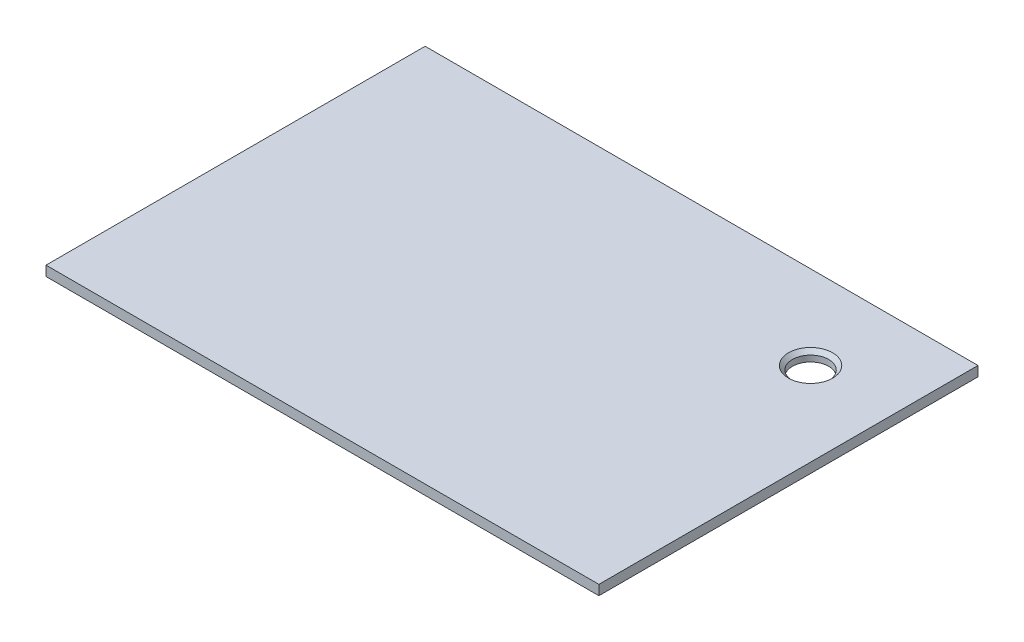
ISO-10303-21;
HEADER;
FILE_DESCRIPTION(('STEP AP214'),'2;1');
FILE_NAME('part.step','',(''),(''),'','','');
FILE_SCHEMA(('AUTOMOTIVE_DESIGN { 1 0 10303 214 1 1 1 1 }'));
ENDSEC;
DATA;
#1=APPLICATION_CONTEXT('core data for automotive mechanical design processes');
#2=APPLICATION_PROTOCOL_DEFINITION('international standard','automotive_design',2000,#1);
#3=PRODUCT_CONTEXT('',#1,'mechanical');
#4=PRODUCT('Part','Part','',(#3));
#5=PRODUCT_RELATED_PRODUCT_CATEGORY('part','',(#4));
#6=PRODUCT_DEFINITION_FORMATION('','',#4);
#7=PRODUCT_DEFINITION_CONTEXT('part definition',#1,'design');
#8=PRODUCT_DEFINITION('design','',#6,#7);
#9=PRODUCT_DEFINITION_SHAPE('','',#8);
#10=(LENGTH_UNIT() NAMED_UNIT(*) SI_UNIT(.MILLI.,.METRE.));
#11=(NAMED_UNIT(*) PLANE_ANGLE_UNIT() SI_UNIT($,.RADIAN.));
#12=(NAMED_UNIT(*) SI_UNIT($,.STERADIAN.) SOLID_ANGLE_UNIT());
#13=UNCERTAINTY_MEASURE_WITH_UNIT(LENGTH_MEASURE(1.E-05),#10,'distance_accuracy_value','');
#14=(GEOMETRIC_REPRESENTATION_CONTEXT(3) GLOBAL_UNCERTAINTY_ASSIGNED_CONTEXT((#13)) GLOBAL_UNIT_ASSIGNED_CONTEXT((#10,
#11,#12)) REPRESENTATION_CONTEXT('',''));
#15=CARTESIAN_POINT('',(0.,0.,0.));
#16=DIRECTION('',(0.,0.,1.));
#17=DIRECTION('',(1.,0.,0.));
#18=AXIS2_PLACEMENT_3D('',#15,#16,#17);
#19=CARTESIAN_POINT('',(0.,3.125,0.));
#20=DIRECTION('',(1.,0.,0.));
#21=DIRECTION('',(0.,0.,-1.));
#22=AXIS2_PLACEMENT_3D('',#19,#20,#21);
#23=PLANE('',#22);
#24=DIRECTION('',(0.,0.,1.));
#25=VECTOR('',#24,1.);
#26=CARTESIAN_POINT('',(0.,0.,0.));
#27=LINE('',#26,#25);
#28=CARTESIAN_POINT('',(0.,0.,-120.));
#29=VERTEX_POINT('',#28);
#30=CARTESIAN_POINT('',(0.,0.,0.));
#31=VERTEX_POINT('',#30);
#32=EDGE_CURVE('E123',#29,#31,#27,.T.);
#33=ORIENTED_EDGE('',*,*,#32,.T.);
#34=DIRECTION('',(0.,-1.,0.));
#35=VECTOR('',#34,1.);
#36=CARTESIAN_POINT('',(0.,3.125,0.));
#37=LINE('',#36,#35);
#38=CARTESIAN_POINT('',(0.,3.125,0.));
#39=VERTEX_POINT('',#38);
#40=EDGE_CURVE('E11',#39,#31,#37,.T.);
#41=ORIENTED_EDGE('',*,*,#40,.F.);
#42=DIRECTION('',(0.,0.,1.));
#43=VECTOR('',#42,1.);
#44=CARTESIAN_POINT('',(0.,3.125,0.));
#45=LINE('',#44,#43);
#46=CARTESIAN_POINT('',(0.,3.125,-120.));
#47=VERTEX_POINT('',#46);
#48=EDGE_CURVE('E106',#47,#39,#45,.T.);
#49=ORIENTED_EDGE('',*,*,#48,.F.);
#50=DIRECTION('',(0.,-1.,0.));
#51=VECTOR('',#50,1.);
#52=CARTESIAN_POINT('',(0.,3.125,-120.));
#53=LINE('',#52,#51);
#54=EDGE_CURVE('E119',#47,#29,#53,.T.);
#55=ORIENTED_EDGE('',*,*,#54,.T.);
#56=EDGE_LOOP('',(#33,#41,#49,#55));
#57=FACE_BOUND('',#56,.T.);
#58=ADVANCED_FACE('F53',(#57),#23,.F.);
#59=CARTESIAN_POINT('',(0.,3.125,0.));
#60=DIRECTION('',(0.,0.,-1.));
#61=DIRECTION('',(-1.,0.,0.));
#62=AXIS2_PLACEMENT_3D('',#59,#60,#61);
#63=PLANE('',#62);
#64=DIRECTION('',(1.,0.,0.));
#65=VECTOR('',#64,1.);
#66=CARTESIAN_POINT('',(0.,0.,0.));
#67=LINE('',#66,#65);
#68=CARTESIAN_POINT('',(175.,0.,0.));
#69=VERTEX_POINT('',#68);
#70=EDGE_CURVE('E111',#31,#69,#67,.T.);
#71=ORIENTED_EDGE('',*,*,#70,.T.);
#72=DIRECTION('',(0.,-1.,0.));
#73=VECTOR('',#72,1.);
#74=CARTESIAN_POINT('',(175.,3.125,0.));
#75=LINE('',#74,#73);
#76=CARTESIAN_POINT('',(175.,3.125,0.));
#77=VERTEX_POINT('',#76);
#78=EDGE_CURVE('E63',#77,#69,#75,.T.);
#79=ORIENTED_EDGE('',*,*,#78,.F.);
#80=DIRECTION('',(1.,0.,0.));
#81=VECTOR('',#80,1.);
#82=CARTESIAN_POINT('',(0.,3.125,0.));
#83=LINE('',#82,#81);
#84=EDGE_CURVE('E101',#39,#77,#83,.T.);
#85=ORIENTED_EDGE('',*,*,#84,.F.);
#86=ORIENTED_EDGE('',*,*,#40,.T.);
#87=EDGE_LOOP('',(#71,#79,#85,#86));
#88=FACE_BOUND('',#87,.T.);
#89=ADVANCED_FACE('F110',(#88),#63,.F.);
#90=CARTESIAN_POINT('',(175.,3.125,0.));
#91=DIRECTION('',(-1.,0.,0.));
#92=DIRECTION('',(0.,0.,1.));
#93=AXIS2_PLACEMENT_3D('',#90,#91,#92);
#94=PLANE('',#93);
#95=DIRECTION('',(0.,0.,-1.));
#96=VECTOR('',#95,1.);
#97=CARTESIAN_POINT('',(175.,0.,0.));
#98=LINE('',#97,#96);
#99=CARTESIAN_POINT('',(175.,0.,-120.));
#100=VERTEX_POINT('',#99);
#101=EDGE_CURVE('E88',#69,#100,#98,.T.);
#102=ORIENTED_EDGE('',*,*,#101,.T.);
#103=DIRECTION('',(0.,-1.,0.));
#104=VECTOR('',#103,1.);
#105=CARTESIAN_POINT('',(175.,3.125,-120.));
#106=LINE('',#105,#104);
#107=CARTESIAN_POINT('',(175.,3.125,-120.));
#108=VERTEX_POINT('',#107);
#109=EDGE_CURVE('E113',#108,#100,#106,.T.);
#110=ORIENTED_EDGE('',*,*,#109,.F.);
#111=DIRECTION('',(0.,0.,-1.));
#112=VECTOR('',#111,1.);
#113=CARTESIAN_POINT('',(175.,3.125,0.));
#114=LINE('',#113,#112);
#115=EDGE_CURVE('E104',#77,#108,#114,.T.);
#116=ORIENTED_EDGE('',*,*,#115,.F.);
#117=ORIENTED_EDGE('',*,*,#78,.T.);
#118=EDGE_LOOP('',(#102,#110,#116,#117));
#119=FACE_BOUND('',#118,.T.);
#120=ADVANCED_FACE('F115',(#119),#94,.F.);
#121=CARTESIAN_POINT('',(0.,3.125,-120.));
#122=DIRECTION('',(0.,0.,1.));
#123=DIRECTION('',(1.,0.,0.));
#124=AXIS2_PLACEMENT_3D('',#121,#122,#123);
#125=PLANE('',#124);
#126=DIRECTION('',(-1.,0.,0.));
#127=VECTOR('',#126,1.);
#128=CARTESIAN_POINT('',(0.,0.,-120.));
#129=LINE('',#128,#127);
#130=EDGE_CURVE('E94',#100,#29,#129,.T.);
#131=ORIENTED_EDGE('',*,*,#130,.T.);
#132=ORIENTED_EDGE('',*,*,#54,.F.);
#133=DIRECTION('',(-1.,0.,0.));
#134=VECTOR('',#133,1.);
#135=CARTESIAN_POINT('',(0.,3.125,-120.));
#136=LINE('',#135,#134);
#137=EDGE_CURVE('E71',#108,#47,#136,.T.);
#138=ORIENTED_EDGE('',*,*,#137,.F.);
#139=ORIENTED_EDGE('',*,*,#109,.T.);
#140=EDGE_LOOP('',(#131,#132,#138,#139));
#141=FACE_BOUND('',#140,.T.);
#142=ADVANCED_FACE('F136',(#141),#125,.F.);
#143=CARTESIAN_POINT('',(0.,3.125,0.));
#144=DIRECTION('',(0.,-1.,0.));
#145=DIRECTION('',(0.,0.,-1.));
#146=AXIS2_PLACEMENT_3D('',#143,#144,#145);
#147=PLANE('',#146);
#148=CARTESIAN_POINT('',(148.5,3.125,-93.5));
#149=DIRECTION('',(0.,1.,0.));
#150=DIRECTION('',(0.,0.,1.));
#151=AXIS2_PLACEMENT_3D('',#148,#149,#150);
#152=CIRCLE('',#151,6.98499999999999);
#153=CARTESIAN_POINT('',(148.5,3.125,-86.515));
#154=VERTEX_POINT('',#153);
#155=EDGE_CURVE('E147',#154,#154,#152,.T.);
#156=ORIENTED_EDGE('',*,*,#155,.F.);
#157=EDGE_LOOP('',(#156));
#158=FACE_BOUND('',#157,.T.);
#159=ORIENTED_EDGE('',*,*,#48,.T.);
#160=ORIENTED_EDGE('',*,*,#84,.T.);
#161=ORIENTED_EDGE('',*,*,#115,.T.);
#162=ORIENTED_EDGE('',*,*,#137,.T.);
#163=EDGE_LOOP('',(#159,#160,#161,#162));
#164=FACE_BOUND('',#163,.T.);
#165=ADVANCED_FACE('F102',(#158,#164),#147,.F.);
#166=CARTESIAN_POINT('',(0.,0.,0.));
#167=DIRECTION('',(0.,-1.,0.));
#168=DIRECTION('',(0.,0.,-1.));
#169=AXIS2_PLACEMENT_3D('',#166,#167,#168);
#170=PLANE('',#169);
#171=CARTESIAN_POINT('',(148.5,0.,-93.5));
#172=DIRECTION('',(0.,-1.,0.));
#173=DIRECTION('',(0.,0.,-1.));
#174=AXIS2_PLACEMENT_3D('',#171,#172,#173);
#175=CIRCLE('',#174,5.75436999999998);
#176=CARTESIAN_POINT('',(148.5,0.,-99.25437));
#177=VERTEX_POINT('',#176);
#178=EDGE_CURVE('E56',#177,#177,#175,.T.);
#179=ORIENTED_EDGE('',*,*,#178,.F.);
#180=EDGE_LOOP('',(#179));
#181=FACE_BOUND('',#180,.T.);
#182=ORIENTED_EDGE('',*,*,#32,.F.);
#183=ORIENTED_EDGE('',*,*,#130,.F.);
#184=ORIENTED_EDGE('',*,*,#101,.F.);
#185=ORIENTED_EDGE('',*,*,#70,.F.);
#186=EDGE_LOOP('',(#182,#183,#184,#185));
#187=FACE_BOUND('',#186,.T.);
#188=ADVANCED_FACE('F139',(#181,#187),#170,.T.);
#189=CARTESIAN_POINT('',(148.5,3.125,-93.5));
#190=DIRECTION('',(0.,1.,0.));
#191=DIRECTION('',(0.,0.,1.));
#192=AXIS2_PLACEMENT_3D('',#189,#190,#191);
#193=CYLINDRICAL_SURFACE('',#192,5.75436999999998);
#194=ORIENTED_EDGE('',*,*,#178,.T.);
#195=EDGE_LOOP('',(#194));
#196=FACE_BOUND('',#195,.T.);
#197=CARTESIAN_POINT('',(148.5,1.89436999999999,-93.5));
#198=DIRECTION('',(0.,1.,0.));
#199=DIRECTION('',(0.,0.,1.));
#200=AXIS2_PLACEMENT_3D('',#197,#198,#199);
#201=CIRCLE('',#200,5.75436999999998);
#202=CARTESIAN_POINT('',(148.5,1.89436999999999,-87.74563));
#203=VERTEX_POINT('',#202);
#204=EDGE_CURVE('E143',#203,#203,#201,.T.);
#205=ORIENTED_EDGE('',*,*,#204,.T.);
#206=EDGE_LOOP('',(#205));
#207=FACE_BOUND('',#206,.T.);
#208=ADVANCED_FACE('F160',(#196,#207),#193,.F.);
#209=CARTESIAN_POINT('',(148.5,3.125,-93.5));
#210=DIRECTION('',(0.,1.,0.));
#211=DIRECTION('',(0.,0.,1.));
#212=AXIS2_PLACEMENT_3D('',#209,#210,#211);
#213=CONICAL_SURFACE('',#212,6.98499999999999,0.785398163397448);
#214=ORIENTED_EDGE('',*,*,#204,.F.);
#215=EDGE_LOOP('',(#214));
#216=FACE_BOUND('',#215,.T.);
#217=ORIENTED_EDGE('',*,*,#155,.T.);
#218=EDGE_LOOP('',(#217));
#219=FACE_BOUND('',#218,.T.);
#220=ADVANCED_FACE('F152',(#216,#219),#213,.F.);
#221=CLOSED_SHELL('',(#58,#89,#120,#142,#165,#188,#208,#220));
#222=MANIFOLD_SOLID_BREP('B2',#221);
#223=ADVANCED_BREP_SHAPE_REPRESENTATION('',(#18,#222),#14);
#224=SHAPE_DEFINITION_REPRESENTATION(#9,#223);
ENDSEC;
END-ISO-10303-21;
